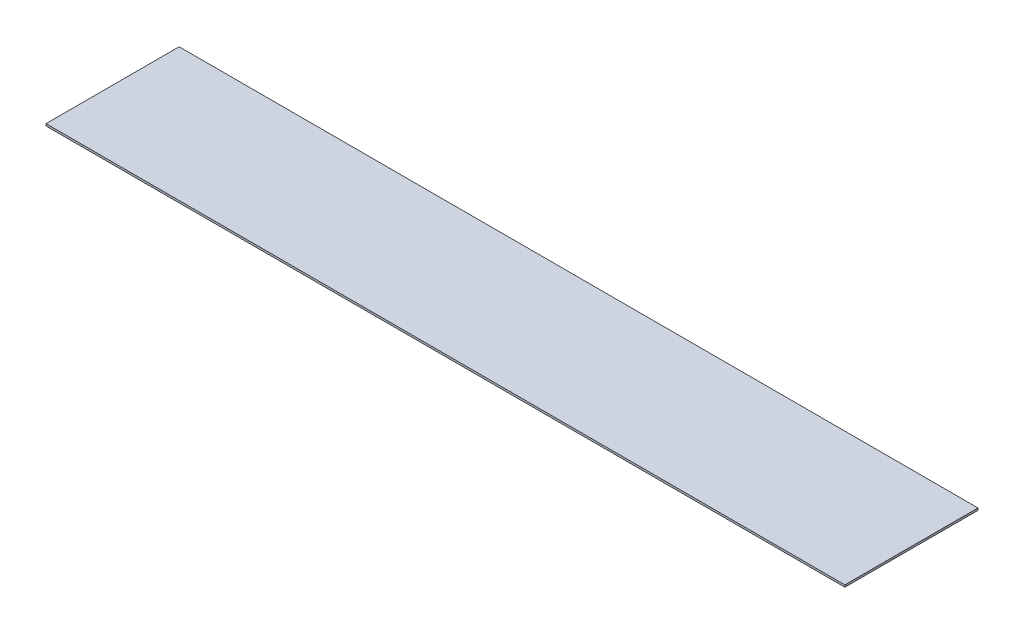
ISO-10303-21;
HEADER;
FILE_DESCRIPTION(('STEP AP214'),'2;1');
FILE_NAME('part.step','',(''),(''),'','','');
FILE_SCHEMA(('AUTOMOTIVE_DESIGN { 1 0 10303 214 1 1 1 1 }'));
ENDSEC;
DATA;
#1=APPLICATION_CONTEXT('core data for automotive mechanical design processes');
#2=APPLICATION_PROTOCOL_DEFINITION('international standard','automotive_design',2000,#1);
#3=PRODUCT_CONTEXT('',#1,'mechanical');
#4=PRODUCT('Part','Part','',(#3));
#5=PRODUCT_RELATED_PRODUCT_CATEGORY('part','',(#4));
#6=PRODUCT_DEFINITION_FORMATION('','',#4);
#7=PRODUCT_DEFINITION_CONTEXT('part definition',#1,'design');
#8=PRODUCT_DEFINITION('design','',#6,#7);
#9=PRODUCT_DEFINITION_SHAPE('','',#8);
#10=(LENGTH_UNIT() NAMED_UNIT(*) SI_UNIT(.MILLI.,.METRE.));
#11=(NAMED_UNIT(*) PLANE_ANGLE_UNIT() SI_UNIT($,.RADIAN.));
#12=(NAMED_UNIT(*) SI_UNIT($,.STERADIAN.) SOLID_ANGLE_UNIT());
#13=UNCERTAINTY_MEASURE_WITH_UNIT(LENGTH_MEASURE(1.E-05),#10,'distance_accuracy_value','');
#14=(GEOMETRIC_REPRESENTATION_CONTEXT(3) GLOBAL_UNCERTAINTY_ASSIGNED_CONTEXT((#13)) GLOBAL_UNIT_ASSIGNED_CONTEXT((#10,
#11,#12)) REPRESENTATION_CONTEXT('',''));
#15=CARTESIAN_POINT('',(0.,0.,0.));
#16=DIRECTION('',(0.,0.,1.));
#17=DIRECTION('',(1.,0.,0.));
#18=AXIS2_PLACEMENT_3D('',#15,#16,#17);
#19=CARTESIAN_POINT('',(0.,-1.5875,0.));
#20=DIRECTION('',(1.,0.,0.));
#21=DIRECTION('',(0.,0.,-1.));
#22=AXIS2_PLACEMENT_3D('',#19,#20,#21);
#23=PLANE('',#22);
#24=DIRECTION('',(0.,0.,-1.));
#25=VECTOR('',#24,1.);
#26=CARTESIAN_POINT('',(0.,0.,0.));
#27=LINE('',#26,#25);
#28=CARTESIAN_POINT('',(0.,0.,101.6));
#29=VERTEX_POINT('',#28);
#30=CARTESIAN_POINT('',(0.,0.,0.));
#31=VERTEX_POINT('',#30);
#32=EDGE_CURVE('E102',#29,#31,#27,.T.);
#33=ORIENTED_EDGE('',*,*,#32,.T.);
#34=DIRECTION('',(0.,1.,0.));
#35=VECTOR('',#34,1.);
#36=CARTESIAN_POINT('',(0.,-1.5875,0.));
#37=LINE('',#36,#35);
#38=CARTESIAN_POINT('',(0.,-1.5875,0.));
#39=VERTEX_POINT('',#38);
#40=EDGE_CURVE('E11',#39,#31,#37,.T.);
#41=ORIENTED_EDGE('',*,*,#40,.F.);
#42=DIRECTION('',(0.,0.,-1.));
#43=VECTOR('',#42,1.);
#44=CARTESIAN_POINT('',(0.,-1.5875,0.));
#45=LINE('',#44,#43);
#46=CARTESIAN_POINT('',(0.,-1.5875,101.6));
#47=VERTEX_POINT('',#46);
#48=EDGE_CURVE('E90',#47,#39,#45,.T.);
#49=ORIENTED_EDGE('',*,*,#48,.F.);
#50=DIRECTION('',(0.,1.,0.));
#51=VECTOR('',#50,1.);
#52=CARTESIAN_POINT('',(0.,-1.5875,101.6));
#53=LINE('',#52,#51);
#54=EDGE_CURVE('E98',#47,#29,#53,.T.);
#55=ORIENTED_EDGE('',*,*,#54,.T.);
#56=EDGE_LOOP('',(#33,#41,#49,#55));
#57=FACE_BOUND('',#56,.T.);
#58=ADVANCED_FACE('F39',(#57),#23,.F.);
#59=CARTESIAN_POINT('',(0.,-1.5875,0.));
#60=DIRECTION('',(0.,0.,1.));
#61=DIRECTION('',(1.,0.,0.));
#62=AXIS2_PLACEMENT_3D('',#59,#60,#61);
#63=PLANE('',#62);
#64=DIRECTION('',(1.,0.,0.));
#65=VECTOR('',#64,1.);
#66=CARTESIAN_POINT('',(0.,0.,0.));
#67=LINE('',#66,#65);
#68=CARTESIAN_POINT('',(609.6,0.,0.));
#69=VERTEX_POINT('',#68);
#70=EDGE_CURVE('E94',#31,#69,#67,.T.);
#71=ORIENTED_EDGE('',*,*,#70,.T.);
#72=DIRECTION('',(0.,1.,0.));
#73=VECTOR('',#72,1.);
#74=CARTESIAN_POINT('',(609.6,-1.5875,0.));
#75=LINE('',#74,#73);
#76=CARTESIAN_POINT('',(609.6,-1.5875,0.));
#77=VERTEX_POINT('',#76);
#78=EDGE_CURVE('E47',#77,#69,#75,.T.);
#79=ORIENTED_EDGE('',*,*,#78,.F.);
#80=DIRECTION('',(1.,0.,0.));
#81=VECTOR('',#80,1.);
#82=CARTESIAN_POINT('',(0.,-1.5875,0.));
#83=LINE('',#82,#81);
#84=EDGE_CURVE('E85',#39,#77,#83,.T.);
#85=ORIENTED_EDGE('',*,*,#84,.F.);
#86=ORIENTED_EDGE('',*,*,#40,.T.);
#87=EDGE_LOOP('',(#71,#79,#85,#86));
#88=FACE_BOUND('',#87,.T.);
#89=ADVANCED_FACE('F93',(#88),#63,.F.);
#90=CARTESIAN_POINT('',(609.6,-1.5875,0.));
#91=DIRECTION('',(-1.,0.,0.));
#92=DIRECTION('',(0.,0.,1.));
#93=AXIS2_PLACEMENT_3D('',#90,#91,#92);
#94=PLANE('',#93);
#95=DIRECTION('',(0.,0.,1.));
#96=VECTOR('',#95,1.);
#97=CARTESIAN_POINT('',(609.6,0.,0.));
#98=LINE('',#97,#96);
#99=CARTESIAN_POINT('',(609.6,0.,101.6));
#100=VERTEX_POINT('',#99);
#101=EDGE_CURVE('E72',#69,#100,#98,.T.);
#102=ORIENTED_EDGE('',*,*,#101,.T.);
#103=DIRECTION('',(0.,1.,0.));
#104=VECTOR('',#103,1.);
#105=CARTESIAN_POINT('',(609.6,-1.5875,101.6));
#106=LINE('',#105,#104);
#107=CARTESIAN_POINT('',(609.6,-1.5875,101.6));
#108=VERTEX_POINT('',#107);
#109=EDGE_CURVE('E95',#108,#100,#106,.T.);
#110=ORIENTED_EDGE('',*,*,#109,.F.);
#111=DIRECTION('',(0.,0.,1.));
#112=VECTOR('',#111,1.);
#113=CARTESIAN_POINT('',(609.6,-1.5875,0.));
#114=LINE('',#113,#112);
#115=EDGE_CURVE('E88',#77,#108,#114,.T.);
#116=ORIENTED_EDGE('',*,*,#115,.F.);
#117=ORIENTED_EDGE('',*,*,#78,.T.);
#118=EDGE_LOOP('',(#102,#110,#116,#117));
#119=FACE_BOUND('',#118,.T.);
#120=ADVANCED_FACE('F96',(#119),#94,.F.);
#121=CARTESIAN_POINT('',(0.,-1.5875,101.6));
#122=DIRECTION('',(0.,0.,-1.));
#123=DIRECTION('',(-1.,0.,0.));
#124=AXIS2_PLACEMENT_3D('',#121,#122,#123);
#125=PLANE('',#124);
#126=DIRECTION('',(-1.,0.,0.));
#127=VECTOR('',#126,1.);
#128=CARTESIAN_POINT('',(0.,0.,101.6));
#129=LINE('',#128,#127);
#130=EDGE_CURVE('E78',#100,#29,#129,.T.);
#131=ORIENTED_EDGE('',*,*,#130,.T.);
#132=ORIENTED_EDGE('',*,*,#54,.F.);
#133=DIRECTION('',(-1.,0.,0.));
#134=VECTOR('',#133,1.);
#135=CARTESIAN_POINT('',(0.,-1.5875,101.6));
#136=LINE('',#135,#134);
#137=EDGE_CURVE('E55',#108,#47,#136,.T.);
#138=ORIENTED_EDGE('',*,*,#137,.F.);
#139=ORIENTED_EDGE('',*,*,#109,.T.);
#140=EDGE_LOOP('',(#131,#132,#138,#139));
#141=FACE_BOUND('',#140,.T.);
#142=ADVANCED_FACE('F109',(#141),#125,.F.);
#143=CARTESIAN_POINT('',(0.,-1.5875,0.));
#144=DIRECTION('',(0.,1.,0.));
#145=DIRECTION('',(0.,0.,1.));
#146=AXIS2_PLACEMENT_3D('',#143,#144,#145);
#147=PLANE('',#146);
#148=ORIENTED_EDGE('',*,*,#48,.T.);
#149=ORIENTED_EDGE('',*,*,#84,.T.);
#150=ORIENTED_EDGE('',*,*,#115,.T.);
#151=ORIENTED_EDGE('',*,*,#137,.T.);
#152=EDGE_LOOP('',(#148,#149,#150,#151));
#153=FACE_BOUND('',#152,.T.);
#154=ADVANCED_FACE('F86',(#153),#147,.F.);
#155=CARTESIAN_POINT('',(0.,0.,0.));
#156=DIRECTION('',(0.,1.,0.));
#157=DIRECTION('',(0.,0.,1.));
#158=AXIS2_PLACEMENT_3D('',#155,#156,#157);
#159=PLANE('',#158);
#160=ORIENTED_EDGE('',*,*,#32,.F.);
#161=ORIENTED_EDGE('',*,*,#130,.F.);
#162=ORIENTED_EDGE('',*,*,#101,.F.);
#163=ORIENTED_EDGE('',*,*,#70,.F.);
#164=EDGE_LOOP('',(#160,#161,#162,#163));
#165=FACE_BOUND('',#164,.T.);
#166=ADVANCED_FACE('F112',(#165),#159,.T.);
#167=CLOSED_SHELL('',(#58,#89,#120,#142,#154,#166));
#168=MANIFOLD_SOLID_BREP('B2',#167);
#169=ADVANCED_BREP_SHAPE_REPRESENTATION('',(#18,#168),#14);
#170=SHAPE_DEFINITION_REPRESENTATION(#9,#169);
ENDSEC;
END-ISO-10303-21;
